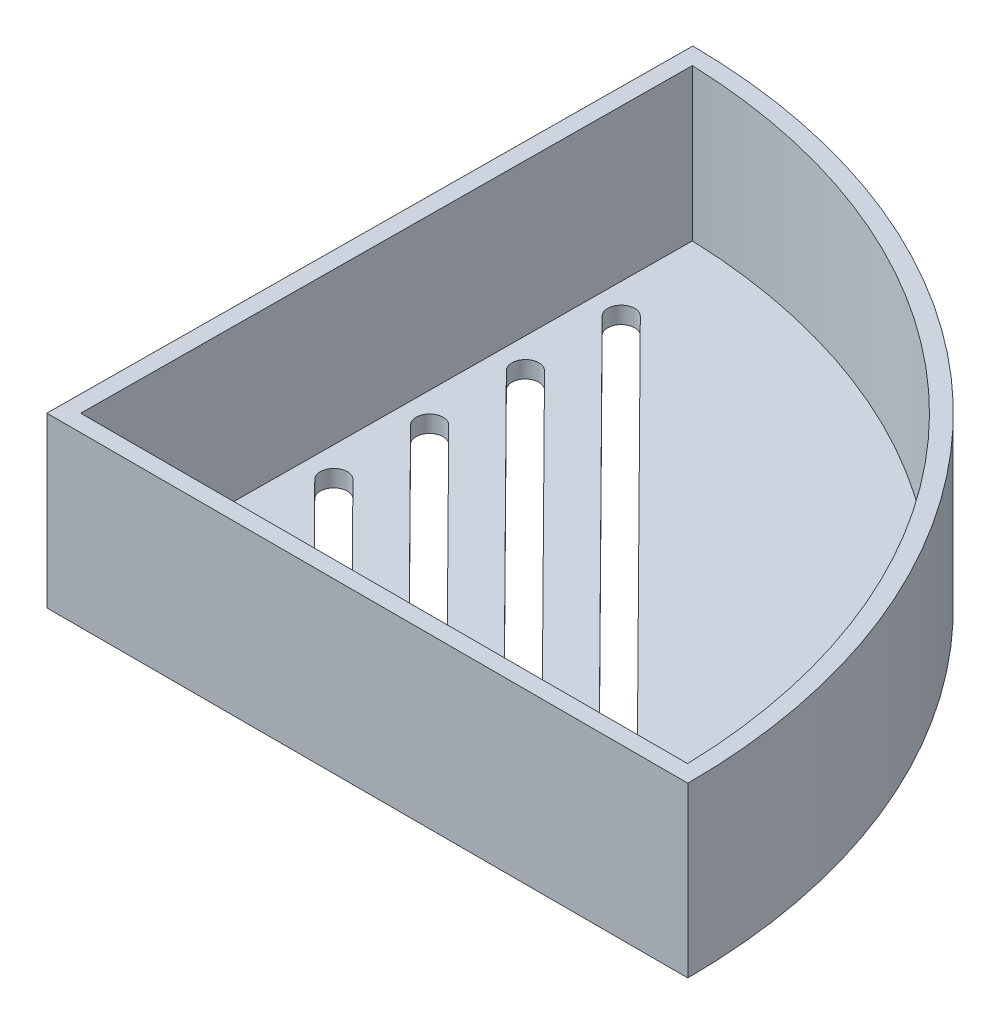
ISO-10303-21;
HEADER;
FILE_DESCRIPTION(('STEP AP214'),'2;1');
FILE_NAME('part.step','',(''),(''),'','','');
FILE_SCHEMA(('AUTOMOTIVE_DESIGN { 1 0 10303 214 1 1 1 1 }'));
ENDSEC;
DATA;
#1=APPLICATION_CONTEXT('core data for automotive mechanical design processes');
#2=APPLICATION_PROTOCOL_DEFINITION('international standard','automotive_design',2000,#1);
#3=PRODUCT_CONTEXT('',#1,'mechanical');
#4=PRODUCT('Part','Part','',(#3));
#5=PRODUCT_RELATED_PRODUCT_CATEGORY('part','',(#4));
#6=PRODUCT_DEFINITION_FORMATION('','',#4);
#7=PRODUCT_DEFINITION_CONTEXT('part definition',#1,'design');
#8=PRODUCT_DEFINITION('design','',#6,#7);
#9=PRODUCT_DEFINITION_SHAPE('','',#8);
#10=(LENGTH_UNIT() NAMED_UNIT(*) SI_UNIT(.MILLI.,.METRE.));
#11=(NAMED_UNIT(*) PLANE_ANGLE_UNIT() SI_UNIT($,.RADIAN.));
#12=(NAMED_UNIT(*) SI_UNIT($,.STERADIAN.) SOLID_ANGLE_UNIT());
#13=UNCERTAINTY_MEASURE_WITH_UNIT(LENGTH_MEASURE(1.E-05),#10,'distance_accuracy_value','');
#14=(GEOMETRIC_REPRESENTATION_CONTEXT(3) GLOBAL_UNCERTAINTY_ASSIGNED_CONTEXT((#13)) GLOBAL_UNIT_ASSIGNED_CONTEXT((#10,
#11,#12)) REPRESENTATION_CONTEXT('',''));
#15=CARTESIAN_POINT('',(0.,0.,0.));
#16=DIRECTION('',(0.,0.,1.));
#17=DIRECTION('',(1.,0.,0.));
#18=AXIS2_PLACEMENT_3D('',#15,#16,#17);
#19=CARTESIAN_POINT('',(0.,50.,0.));
#20=DIRECTION('',(0.,0.,-1.));
#21=DIRECTION('',(-1.,0.,0.));
#22=AXIS2_PLACEMENT_3D('',#19,#20,#21);
#23=PLANE('',#22);
#24=DIRECTION('',(1.,0.,0.));
#25=VECTOR('',#24,1.);
#26=CARTESIAN_POINT('',(0.,0.,0.));
#27=LINE('',#26,#25);
#28=CARTESIAN_POINT('',(0.,0.,0.));
#29=VERTEX_POINT('',#28);
#30=CARTESIAN_POINT('',(190.,0.,0.));
#31=VERTEX_POINT('',#30);
#32=EDGE_CURVE('E394',#29,#31,#27,.T.);
#33=ORIENTED_EDGE('',*,*,#32,.T.);
#34=DIRECTION('',(0.,-1.,0.));
#35=VECTOR('',#34,1.);
#36=CARTESIAN_POINT('',(190.,50.,0.));
#37=LINE('',#36,#35);
#38=CARTESIAN_POINT('',(190.,50.,0.));
#39=VERTEX_POINT('',#38);
#40=EDGE_CURVE('E428',#39,#31,#37,.T.);
#41=ORIENTED_EDGE('',*,*,#40,.F.);
#42=DIRECTION('',(1.,0.,0.));
#43=VECTOR('',#42,1.);
#44=CARTESIAN_POINT('',(0.,50.,0.));
#45=LINE('',#44,#43);
#46=CARTESIAN_POINT('',(0.,50.,0.));
#47=VERTEX_POINT('',#46);
#48=EDGE_CURVE('E401',#47,#39,#45,.T.);
#49=ORIENTED_EDGE('',*,*,#48,.F.);
#50=DIRECTION('',(0.,-1.,0.));
#51=VECTOR('',#50,1.);
#52=CARTESIAN_POINT('',(0.,50.,0.));
#53=LINE('',#52,#51);
#54=EDGE_CURVE('E412',#47,#29,#53,.T.);
#55=ORIENTED_EDGE('',*,*,#54,.T.);
#56=EDGE_LOOP('',(#33,#41,#49,#55));
#57=FACE_BOUND('',#56,.T.);
#58=ADVANCED_FACE('F43',(#57),#23,.F.);
#59=CARTESIAN_POINT('',(0.,50.,0.));
#60=DIRECTION('',(0.,-1.,0.));
#61=DIRECTION('',(0.,0.,-1.));
#62=AXIS2_PLACEMENT_3D('',#59,#60,#61);
#63=CYLINDRICAL_SURFACE('',#62,190.);
#64=CARTESIAN_POINT('',(0.,0.,0.));
#65=DIRECTION('',(0.,1.,0.));
#66=DIRECTION('',(0.,0.,1.));
#67=AXIS2_PLACEMENT_3D('',#64,#65,#66);
#68=CIRCLE('',#67,190.);
#69=CARTESIAN_POINT('',(1.49601661623701,0.,-189.994110262092));
#70=VERTEX_POINT('',#69);
#71=EDGE_CURVE('E416',#31,#70,#68,.T.);
#72=ORIENTED_EDGE('',*,*,#71,.T.);
#73=DIRECTION('',(0.,-1.,0.));
#74=VECTOR('',#73,1.);
#75=CARTESIAN_POINT('',(1.49601661623701,50.,-189.994110262092));
#76=LINE('',#75,#74);
#77=CARTESIAN_POINT('',(1.49601661623701,50.,-189.994110262092));
#78=VERTEX_POINT('',#77);
#79=EDGE_CURVE('E424',#78,#70,#76,.T.);
#80=ORIENTED_EDGE('',*,*,#79,.F.);
#81=CARTESIAN_POINT('',(0.,50.,0.));
#82=DIRECTION('',(0.,1.,0.));
#83=DIRECTION('',(0.,0.,1.));
#84=AXIS2_PLACEMENT_3D('',#81,#82,#83);
#85=CIRCLE('',#84,190.);
#86=EDGE_CURVE('E405',#39,#78,#85,.T.);
#87=ORIENTED_EDGE('',*,*,#86,.F.);
#88=ORIENTED_EDGE('',*,*,#40,.T.);
#89=EDGE_LOOP('',(#72,#80,#87,#88));
#90=FACE_BOUND('',#89,.T.);
#91=ADVANCED_FACE('F540',(#90),#63,.T.);
#92=CARTESIAN_POINT('',(1.49601661623701,50.,-189.994110262092));
#93=DIRECTION('',(0.999969001379431,0.,0.00787377166440531));
#94=DIRECTION('',(0.00787377166440531,0.,-0.999969001379431));
#95=AXIS2_PLACEMENT_3D('',#92,#93,#94);
#96=PLANE('',#95);
#97=DIRECTION('',(-0.00787377166440531,0.,0.999969001379431));
#98=VECTOR('',#97,1.);
#99=CARTESIAN_POINT('',(1.49601661623701,0.,-189.994110262092));
#100=LINE('',#99,#98);
#101=EDGE_CURVE('E406',#70,#29,#100,.T.);
#102=ORIENTED_EDGE('',*,*,#101,.T.);
#103=ORIENTED_EDGE('',*,*,#54,.F.);
#104=DIRECTION('',(-0.00787377166440531,0.,0.999969001379431));
#105=VECTOR('',#104,1.);
#106=CARTESIAN_POINT('',(1.49601661623701,50.,-189.994110262092));
#107=LINE('',#106,#105);
#108=EDGE_CURVE('E409',#78,#47,#107,.T.);
#109=ORIENTED_EDGE('',*,*,#108,.F.);
#110=ORIENTED_EDGE('',*,*,#79,.T.);
#111=EDGE_LOOP('',(#102,#103,#109,#110));
#112=FACE_BOUND('',#111,.T.);
#113=ADVANCED_FACE('F545',(#112),#96,.F.);
#114=CARTESIAN_POINT('',(0.,50.,0.));
#115=DIRECTION('',(0.,1.,0.));
#116=DIRECTION('',(0.,0.,1.));
#117=AXIS2_PLACEMENT_3D('',#114,#115,#116);
#118=PLANE('',#117);
#119=DIRECTION('',(-0.00787377166440531,0.,0.999969001379431));
#120=VECTOR('',#119,1.);
#121=CARTESIAN_POINT('',(6.45596065602437,50.,-184.887318580826));
#122=LINE('',#121,#120);
#123=CARTESIAN_POINT('',(6.45596065602437,50.,-184.887318580826));
#124=VERTEX_POINT('',#123);
#125=CARTESIAN_POINT('',(5.03952507664773,50.,-5.));
#126=VERTEX_POINT('',#125);
#127=EDGE_CURVE('E358',#124,#126,#122,.T.);
#128=ORIENTED_EDGE('',*,*,#127,.F.);
#129=CARTESIAN_POINT('',(0.,50.,0.));
#130=DIRECTION('',(0.,1.,0.));
#131=DIRECTION('',(0.,0.,1.));
#132=AXIS2_PLACEMENT_3D('',#129,#130,#131);
#133=CIRCLE('',#132,185.);
#134=CARTESIAN_POINT('',(184.932420089069,50.,-4.99999999999999));
#135=VERTEX_POINT('',#134);
#136=EDGE_CURVE('E373',#135,#124,#133,.T.);
#137=ORIENTED_EDGE('',*,*,#136,.F.);
#138=DIRECTION('',(1.,0.,0.));
#139=VECTOR('',#138,1.);
#140=CARTESIAN_POINT('',(5.03952507664773,50.,-5.));
#141=LINE('',#140,#139);
#142=EDGE_CURVE('E384',#126,#135,#141,.T.);
#143=ORIENTED_EDGE('',*,*,#142,.F.);
#144=EDGE_LOOP('',(#128,#137,#143));
#145=FACE_BOUND('',#144,.T.);
#146=ORIENTED_EDGE('',*,*,#48,.T.);
#147=ORIENTED_EDGE('',*,*,#86,.T.);
#148=ORIENTED_EDGE('',*,*,#108,.T.);
#149=EDGE_LOOP('',(#146,#147,#148));
#150=FACE_BOUND('',#149,.T.);
#151=ADVANCED_FACE('F512',(#145,#150),#118,.T.);
#152=CARTESIAN_POINT('',(0.,0.,0.));
#153=DIRECTION('',(0.,1.,0.));
#154=DIRECTION('',(0.,0.,1.));
#155=AXIS2_PLACEMENT_3D('',#152,#153,#154);
#156=PLANE('',#155);
#157=DIRECTION('',(0.704317481089173,0.,0.709885121574049));
#158=VECTOR('',#157,1.);
#159=CARTESIAN_POINT('',(17.838899647507,0.,-129.680766142191));
#160=LINE('',#159,#158);
#161=CARTESIAN_POINT('',(17.838899647507,0.,-129.680766142191));
#162=VERTEX_POINT('',#161);
#163=CARTESIAN_POINT('',(129.817205639895,0.,-16.8172699243567));
#164=VERTEX_POINT('',#163);
#165=EDGE_CURVE('E261',#162,#164,#160,.T.);
#166=ORIENTED_EDGE('',*,*,#165,.F.);
#167=CARTESIAN_POINT('',(14.9993591612108,0.,-126.863496217835));
#168=DIRECTION('',(0.,-1.,0.));
#169=DIRECTION('',(0.,0.,-1.));
#170=AXIS2_PLACEMENT_3D('',#167,#168,#169);
#171=CIRCLE('',#170,3.99999999999999);
#172=CARTESIAN_POINT('',(12.1598186749146,0.,-124.046226293478));
#173=VERTEX_POINT('',#172);
#174=EDGE_CURVE('E58',#173,#162,#171,.T.);
#175=ORIENTED_EDGE('',*,*,#174,.F.);
#176=DIRECTION('',(-0.704317481089173,0.,-0.709885121574049));
#177=VECTOR('',#176,1.);
#178=CARTESIAN_POINT('',(12.1598186749146,0.,-124.046226293478));
#179=LINE('',#178,#177);
#180=CARTESIAN_POINT('',(124.138124667303,0.,-11.1827300756433));
#181=VERTEX_POINT('',#180);
#182=EDGE_CURVE('E269',#181,#173,#179,.T.);
#183=ORIENTED_EDGE('',*,*,#182,.F.);
#184=CARTESIAN_POINT('',(126.977665153599,0.,-14.));
#185=DIRECTION('',(0.,-1.,0.));
#186=DIRECTION('',(0.,0.,-1.));
#187=AXIS2_PLACEMENT_3D('',#184,#185,#186);
#188=CIRCLE('',#187,4.);
#189=EDGE_CURVE('E265',#164,#181,#188,.T.);
#190=ORIENTED_EDGE('',*,*,#189,.F.);
#191=EDGE_LOOP('',(#166,#175,#183,#190));
#192=FACE_BOUND('',#191,.T.);
#193=DIRECTION('',(0.704317481089173,0.,0.709885121574049));
#194=VECTOR('',#193,1.);
#195=CARTESIAN_POINT('',(17.6170673699986,0.,-101.508066898624));
#196=LINE('',#195,#194);
#197=CARTESIAN_POINT('',(17.6170673699985,0.,-101.508066898624));
#198=VERTEX_POINT('',#197);
#199=CARTESIAN_POINT('',(101.643633054442,0.,-16.8172699243567));
#200=VERTEX_POINT('',#199);
#201=EDGE_CURVE('E287',#198,#200,#196,.T.);
#202=ORIENTED_EDGE('',*,*,#201,.F.);
#203=CARTESIAN_POINT('',(14.7775268837024,0.,-98.6907969742677));
#204=DIRECTION('',(0.,-1.,0.));
#205=DIRECTION('',(0.,0.,-1.));
#206=AXIS2_PLACEMENT_3D('',#203,#204,#205);
#207=CIRCLE('',#206,4.00000000000001);
#208=CARTESIAN_POINT('',(11.9379863974062,0.,-95.873527049911));
#209=VERTEX_POINT('',#208);
#210=EDGE_CURVE('E66',#209,#198,#207,.T.);
#211=ORIENTED_EDGE('',*,*,#210,.F.);
#212=DIRECTION('',(-0.704317481089173,0.,-0.709885121574049));
#213=VECTOR('',#212,1.);
#214=CARTESIAN_POINT('',(11.9379863974062,0.,-95.873527049911));
#215=LINE('',#214,#213);
#216=CARTESIAN_POINT('',(95.9645520818493,0.,-11.1827300756433));
#217=VERTEX_POINT('',#216);
#218=EDGE_CURVE('E295',#217,#209,#215,.T.);
#219=ORIENTED_EDGE('',*,*,#218,.F.);
#220=CARTESIAN_POINT('',(98.8040925681455,0.,-14.));
#221=DIRECTION('',(0.,-1.,0.));
#222=DIRECTION('',(0.,0.,-1.));
#223=AXIS2_PLACEMENT_3D('',#220,#221,#222);
#224=CIRCLE('',#223,4.00000000000001);
#225=EDGE_CURVE('E291',#200,#217,#224,.T.);
#226=ORIENTED_EDGE('',*,*,#225,.F.);
#227=EDGE_LOOP('',(#202,#211,#219,#226));
#228=FACE_BOUND('',#227,.T.);
#229=DIRECTION('',(0.704317481089173,0.,0.709885121574049));
#230=VECTOR('',#229,1.);
#231=CARTESIAN_POINT('',(18.0607319250154,0.,-157.853465385758));
#232=LINE('',#231,#230);
#233=CARTESIAN_POINT('',(18.0607319250154,0.,-157.853465385758));
#234=VERTEX_POINT('',#233);
#235=CARTESIAN_POINT('',(157.990778225349,0.,-16.8172699243567));
#236=VERTEX_POINT('',#235);
#237=EDGE_CURVE('E234',#234,#236,#232,.T.);
#238=ORIENTED_EDGE('',*,*,#237,.F.);
#239=CARTESIAN_POINT('',(15.2211914387192,0.,-155.036195461402));
#240=DIRECTION('',(0.,-1.,0.));
#241=DIRECTION('',(0.,0.,-1.));
#242=AXIS2_PLACEMENT_3D('',#239,#240,#241);
#243=CIRCLE('',#242,3.99999999999999);
#244=CARTESIAN_POINT('',(12.381650952423,0.,-152.218925537045));
#245=VERTEX_POINT('',#244);
#246=EDGE_CURVE('E240',#245,#234,#243,.T.);
#247=ORIENTED_EDGE('',*,*,#246,.F.);
#248=DIRECTION('',(-0.704317481089173,0.,-0.709885121574049));
#249=VECTOR('',#248,1.);
#250=CARTESIAN_POINT('',(12.381650952423,0.,-152.218925537045));
#251=LINE('',#250,#249);
#252=CARTESIAN_POINT('',(152.311697252756,0.,-11.1827300756433));
#253=VERTEX_POINT('',#252);
#254=EDGE_CURVE('E245',#253,#245,#251,.T.);
#255=ORIENTED_EDGE('',*,*,#254,.F.);
#256=CARTESIAN_POINT('',(155.151237739053,0.,-14.));
#257=DIRECTION('',(0.,-1.,0.));
#258=DIRECTION('',(0.,0.,-1.));
#259=AXIS2_PLACEMENT_3D('',#256,#257,#258);
#260=CIRCLE('',#259,3.99999999999999);
#261=EDGE_CURVE('E222',#236,#253,#260,.T.);
#262=ORIENTED_EDGE('',*,*,#261,.F.);
#263=EDGE_LOOP('',(#238,#247,#255,#262));
#264=FACE_BOUND('',#263,.T.);
#265=DIRECTION('',(0.704317481089173,0.,0.709885121574049));
#266=VECTOR('',#265,1.);
#267=CARTESIAN_POINT('',(17.3952350924902,0.,-73.3353676550575));
#268=LINE('',#267,#266);
#269=CARTESIAN_POINT('',(17.3952350924901,0.,-73.3353676550575));
#270=VERTEX_POINT('',#269);
#271=CARTESIAN_POINT('',(73.4700604689882,0.,-16.8172699243567));
#272=VERTEX_POINT('',#271);
#273=EDGE_CURVE('E314',#270,#272,#268,.T.);
#274=ORIENTED_EDGE('',*,*,#273,.F.);
#275=CARTESIAN_POINT('',(14.5556946061939,0.,-70.5180977307008));
#276=DIRECTION('',(0.,-1.,0.));
#277=DIRECTION('',(0.,0.,-1.));
#278=AXIS2_PLACEMENT_3D('',#275,#276,#277);
#279=CIRCLE('',#278,4.00000000000001);
#280=CARTESIAN_POINT('',(11.7161541198977,0.,-67.7008278063441));
#281=VERTEX_POINT('',#280);
#282=EDGE_CURVE('E303',#281,#270,#279,.T.);
#283=ORIENTED_EDGE('',*,*,#282,.F.);
#284=DIRECTION('',(-0.704317481089173,0.,-0.709885121574049));
#285=VECTOR('',#284,1.);
#286=CARTESIAN_POINT('',(11.7161541198977,0.,-67.7008278063441));
#287=LINE('',#286,#285);
#288=CARTESIAN_POINT('',(67.7909794963957,0.,-11.1827300756433));
#289=VERTEX_POINT('',#288);
#290=EDGE_CURVE('E322',#289,#281,#287,.T.);
#291=ORIENTED_EDGE('',*,*,#290,.F.);
#292=CARTESIAN_POINT('',(70.6305199826919,0.,-14.));
#293=DIRECTION('',(0.,-1.,0.));
#294=DIRECTION('',(0.,0.,-1.));
#295=AXIS2_PLACEMENT_3D('',#292,#293,#294);
#296=CIRCLE('',#295,4.00000000000002);
#297=EDGE_CURVE('E318',#272,#289,#296,.T.);
#298=ORIENTED_EDGE('',*,*,#297,.F.);
#299=EDGE_LOOP('',(#274,#283,#291,#298));
#300=FACE_BOUND('',#299,.T.);
#301=DIRECTION('',(0.704317481089173,0.,0.709885121574049));
#302=VECTOR('',#301,1.);
#303=CARTESIAN_POINT('',(17.1734028149817,0.,-45.1626684114906));
#304=LINE('',#303,#302);
#305=CARTESIAN_POINT('',(17.1734028149817,0.,-45.1626684114906));
#306=VERTEX_POINT('',#305);
#307=CARTESIAN_POINT('',(45.2964878835346,0.,-16.8172699243566));
#308=VERTEX_POINT('',#307);
#309=EDGE_CURVE('E342',#306,#308,#304,.T.);
#310=ORIENTED_EDGE('',*,*,#309,.F.);
#311=CARTESIAN_POINT('',(14.3338623286855,0.,-42.3453984871339));
#312=DIRECTION('',(0.,-1.,0.));
#313=DIRECTION('',(0.,0.,-1.));
#314=AXIS2_PLACEMENT_3D('',#311,#312,#313);
#315=CIRCLE('',#314,3.99999999999999);
#316=CARTESIAN_POINT('',(11.4943218423893,0.,-39.5281285627772));
#317=VERTEX_POINT('',#316);
#318=EDGE_CURVE('E330',#317,#306,#315,.T.);
#319=ORIENTED_EDGE('',*,*,#318,.F.);
#320=DIRECTION('',(-0.704317481089173,0.,-0.709885121574049));
#321=VECTOR('',#320,1.);
#322=CARTESIAN_POINT('',(11.4943218423893,0.,-39.5281285627772));
#323=LINE('',#322,#321);
#324=CARTESIAN_POINT('',(39.6174069109422,0.,-11.1827300756433));
#325=VERTEX_POINT('',#324);
#326=EDGE_CURVE('E350',#325,#317,#323,.T.);
#327=ORIENTED_EDGE('',*,*,#326,.F.);
#328=CARTESIAN_POINT('',(42.4569473972384,0.,-14.));
#329=DIRECTION('',(0.,-1.,0.));
#330=DIRECTION('',(0.,0.,-1.));
#331=AXIS2_PLACEMENT_3D('',#328,#329,#330);
#332=CIRCLE('',#331,3.99999999999999);
#333=EDGE_CURVE('E346',#308,#325,#332,.T.);
#334=ORIENTED_EDGE('',*,*,#333,.F.);
#335=EDGE_LOOP('',(#310,#319,#327,#334));
#336=FACE_BOUND('',#335,.T.);
#337=ORIENTED_EDGE('',*,*,#32,.F.);
#338=ORIENTED_EDGE('',*,*,#101,.F.);
#339=ORIENTED_EDGE('',*,*,#71,.F.);
#340=EDGE_LOOP('',(#337,#338,#339));
#341=FACE_BOUND('',#340,.T.);
#342=ADVANCED_FACE('F242',(#192,#228,#264,#300,#336,#341),#156,.F.);
#343=CARTESIAN_POINT('',(6.45596065602437,5.,-184.887318580826));
#344=DIRECTION('',(-0.999969001379431,0.,-0.00787377166440531));
#345=DIRECTION('',(-0.00787377166440531,0.,0.999969001379431));
#346=AXIS2_PLACEMENT_3D('',#343,#344,#345);
#347=PLANE('',#346);
#348=ORIENTED_EDGE('',*,*,#127,.T.);
#349=DIRECTION('',(0.,1.,0.));
#350=VECTOR('',#349,1.);
#351=CARTESIAN_POINT('',(5.03952507664773,5.,-5.));
#352=LINE('',#351,#350);
#353=CARTESIAN_POINT('',(5.03952507664773,5.,-5.));
#354=VERTEX_POINT('',#353);
#355=EDGE_CURVE('E381',#354,#126,#352,.T.);
#356=ORIENTED_EDGE('',*,*,#355,.F.);
#357=DIRECTION('',(-0.00787377166440531,0.,0.999969001379431));
#358=VECTOR('',#357,1.);
#359=CARTESIAN_POINT('',(6.45596065602437,5.,-184.887318580826));
#360=LINE('',#359,#358);
#361=CARTESIAN_POINT('',(6.45596065602437,5.,-184.887318580826));
#362=VERTEX_POINT('',#361);
#363=EDGE_CURVE('E368',#362,#354,#360,.T.);
#364=ORIENTED_EDGE('',*,*,#363,.F.);
#365=DIRECTION('',(0.,1.,0.));
#366=VECTOR('',#365,1.);
#367=CARTESIAN_POINT('',(6.45596065602437,5.,-184.887318580826));
#368=LINE('',#367,#366);
#369=EDGE_CURVE('E391',#362,#124,#368,.T.);
#370=ORIENTED_EDGE('',*,*,#369,.T.);
#371=EDGE_LOOP('',(#348,#356,#364,#370));
#372=FACE_BOUND('',#371,.T.);
#373=ADVANCED_FACE('F511',(#372),#347,.F.);
#374=CARTESIAN_POINT('',(0.,5.,0.));
#375=DIRECTION('',(0.,1.,0.));
#376=DIRECTION('',(0.,0.,1.));
#377=AXIS2_PLACEMENT_3D('',#374,#375,#376);
#378=CYLINDRICAL_SURFACE('',#377,185.);
#379=ORIENTED_EDGE('',*,*,#136,.T.);
#380=ORIENTED_EDGE('',*,*,#369,.F.);
#381=CARTESIAN_POINT('',(0.,5.,0.));
#382=DIRECTION('',(0.,1.,0.));
#383=DIRECTION('',(0.,0.,1.));
#384=AXIS2_PLACEMENT_3D('',#381,#382,#383);
#385=CIRCLE('',#384,185.);
#386=CARTESIAN_POINT('',(184.932420089069,5.,-4.99999999999999));
#387=VERTEX_POINT('',#386);
#388=EDGE_CURVE('E377',#387,#362,#385,.T.);
#389=ORIENTED_EDGE('',*,*,#388,.F.);
#390=DIRECTION('',(0.,1.,0.));
#391=VECTOR('',#390,1.);
#392=CARTESIAN_POINT('',(184.932420089069,5.,-4.99999999999999));
#393=LINE('',#392,#391);
#394=EDGE_CURVE('E395',#387,#135,#393,.T.);
#395=ORIENTED_EDGE('',*,*,#394,.T.);
#396=EDGE_LOOP('',(#379,#380,#389,#395));
#397=FACE_BOUND('',#396,.T.);
#398=ADVANCED_FACE('F567',(#397),#378,.F.);
#399=CARTESIAN_POINT('',(5.03952507664773,5.,-5.));
#400=DIRECTION('',(0.,0.,1.));
#401=DIRECTION('',(1.,0.,0.));
#402=AXIS2_PLACEMENT_3D('',#399,#400,#401);
#403=PLANE('',#402);
#404=ORIENTED_EDGE('',*,*,#142,.T.);
#405=ORIENTED_EDGE('',*,*,#394,.F.);
#406=DIRECTION('',(1.,0.,0.));
#407=VECTOR('',#406,1.);
#408=CARTESIAN_POINT('',(5.03952507664773,5.,-5.));
#409=LINE('',#408,#407);
#410=EDGE_CURVE('E372',#354,#387,#409,.T.);
#411=ORIENTED_EDGE('',*,*,#410,.F.);
#412=ORIENTED_EDGE('',*,*,#355,.T.);
#413=EDGE_LOOP('',(#404,#405,#411,#412));
#414=FACE_BOUND('',#413,.T.);
#415=ADVANCED_FACE('F569',(#414),#403,.F.);
#416=CARTESIAN_POINT('',(0.,5.,0.));
#417=DIRECTION('',(0.,1.,0.));
#418=DIRECTION('',(0.,0.,1.));
#419=AXIS2_PLACEMENT_3D('',#416,#417,#418);
#420=PLANE('',#419);
#421=CARTESIAN_POINT('',(14.9993591612108,5.,-126.863496217835));
#422=DIRECTION('',(0.,1.,0.));
#423=DIRECTION('',(0.,0.,1.));
#424=AXIS2_PLACEMENT_3D('',#421,#422,#423);
#425=CIRCLE('',#424,3.99999999999999);
#426=CARTESIAN_POINT('',(17.838899647507,5.,-129.680766142191));
#427=VERTEX_POINT('',#426);
#428=CARTESIAN_POINT('',(12.1598186749146,5.,-124.046226293478));
#429=VERTEX_POINT('',#428);
#430=EDGE_CURVE('E11',#427,#429,#425,.T.);
#431=ORIENTED_EDGE('',*,*,#430,.F.);
#432=DIRECTION('',(-0.704317481089173,0.,-0.709885121574049));
#433=VECTOR('',#432,1.);
#434=CARTESIAN_POINT('',(73.8280526437011,5.,-73.249018033274));
#435=LINE('',#434,#433);
#436=CARTESIAN_POINT('',(129.817205639895,5.,-16.8172699243567));
#437=VERTEX_POINT('',#436);
#438=EDGE_CURVE('E482',#437,#427,#435,.T.);
#439=ORIENTED_EDGE('',*,*,#438,.F.);
#440=CARTESIAN_POINT('',(126.977665153599,5.,-14.));
#441=DIRECTION('',(0.,1.,0.));
#442=DIRECTION('',(0.,0.,1.));
#443=AXIS2_PLACEMENT_3D('',#440,#441,#442);
#444=CIRCLE('',#443,4.);
#445=CARTESIAN_POINT('',(124.138124667303,5.,-11.1827300756433));
#446=VERTEX_POINT('',#445);
#447=EDGE_CURVE('E485',#446,#437,#444,.T.);
#448=ORIENTED_EDGE('',*,*,#447,.F.);
#449=DIRECTION('',(0.704317481089173,0.,0.709885121574049));
#450=VECTOR('',#449,1.);
#451=CARTESIAN_POINT('',(68.1489716711087,5.,-67.6144781845606));
#452=LINE('',#451,#450);
#453=EDGE_CURVE('E51',#429,#446,#452,.T.);
#454=ORIENTED_EDGE('',*,*,#453,.F.);
#455=EDGE_LOOP('',(#431,#439,#448,#454));
#456=FACE_BOUND('',#455,.T.);
#457=CARTESIAN_POINT('',(14.7775268837024,5.,-98.6907969742677));
#458=DIRECTION('',(0.,1.,0.));
#459=DIRECTION('',(0.,0.,1.));
#460=AXIS2_PLACEMENT_3D('',#457,#458,#459);
#461=CIRCLE('',#460,4.00000000000001);
#462=CARTESIAN_POINT('',(17.6170673699986,5.,-101.508066898624));
#463=VERTEX_POINT('',#462);
#464=CARTESIAN_POINT('',(11.9379863974062,5.,-95.873527049911));
#465=VERTEX_POINT('',#464);
#466=EDGE_CURVE('E479',#463,#465,#461,.T.);
#467=ORIENTED_EDGE('',*,*,#466,.F.);
#468=DIRECTION('',(-0.704317481089173,0.,-0.709885121574049));
#469=VECTOR('',#468,1.);
#470=CARTESIAN_POINT('',(59.6303502122202,5.,-59.1626684114905));
#471=LINE('',#470,#469);
#472=CARTESIAN_POINT('',(101.643633054442,5.,-16.8172699243567));
#473=VERTEX_POINT('',#472);
#474=EDGE_CURVE('E469',#473,#463,#471,.T.);
#475=ORIENTED_EDGE('',*,*,#474,.F.);
#476=CARTESIAN_POINT('',(98.8040925681455,5.,-14.));
#477=DIRECTION('',(0.,1.,0.));
#478=DIRECTION('',(0.,0.,1.));
#479=AXIS2_PLACEMENT_3D('',#476,#477,#478);
#480=CIRCLE('',#479,4.00000000000001);
#481=CARTESIAN_POINT('',(95.9645520818493,5.,-11.1827300756433));
#482=VERTEX_POINT('',#481);
#483=EDGE_CURVE('E472',#482,#473,#480,.T.);
#484=ORIENTED_EDGE('',*,*,#483,.F.);
#485=DIRECTION('',(0.704317481089173,0.,0.709885121574049));
#486=VECTOR('',#485,1.);
#487=CARTESIAN_POINT('',(53.9512692396277,5.,-53.5281285627772));
#488=LINE('',#487,#486);
#489=EDGE_CURVE('E476',#465,#482,#488,.T.);
#490=ORIENTED_EDGE('',*,*,#489,.F.);
#491=EDGE_LOOP('',(#467,#475,#484,#490));
#492=FACE_BOUND('',#491,.T.);
#493=CARTESIAN_POINT('',(15.2211914387192,5.,-155.036195461402));
#494=DIRECTION('',(0.,1.,0.));
#495=DIRECTION('',(0.,0.,1.));
#496=AXIS2_PLACEMENT_3D('',#493,#494,#495);
#497=CIRCLE('',#496,3.99999999999999);
#498=CARTESIAN_POINT('',(18.0607319250154,5.,-157.853465385758));
#499=VERTEX_POINT('',#498);
#500=CARTESIAN_POINT('',(12.381650952423,5.,-152.218925537045));
#501=VERTEX_POINT('',#500);
#502=EDGE_CURVE('E466',#499,#501,#497,.T.);
#503=ORIENTED_EDGE('',*,*,#502,.F.);
#504=DIRECTION('',(-0.704317481089173,0.,-0.709885121574049));
#505=VECTOR('',#504,1.);
#506=CARTESIAN_POINT('',(88.0257550751821,5.,-87.3353676550574));
#507=LINE('',#506,#505);
#508=CARTESIAN_POINT('',(157.990778225349,5.,-16.8172699243567));
#509=VERTEX_POINT('',#508);
#510=EDGE_CURVE('E458',#509,#499,#507,.T.);
#511=ORIENTED_EDGE('',*,*,#510,.F.);
#512=CARTESIAN_POINT('',(155.151237739053,5.,-14.));
#513=DIRECTION('',(0.,1.,0.));
#514=DIRECTION('',(0.,0.,1.));
#515=AXIS2_PLACEMENT_3D('',#512,#513,#514);
#516=CIRCLE('',#515,3.99999999999999);
#517=CARTESIAN_POINT('',(152.311697252756,5.,-11.1827300756433));
#518=VERTEX_POINT('',#517);
#519=EDGE_CURVE('E225',#518,#509,#516,.T.);
#520=ORIENTED_EDGE('',*,*,#519,.F.);
#521=DIRECTION('',(0.704317481089173,0.,0.709885121574049));
#522=VECTOR('',#521,1.);
#523=CARTESIAN_POINT('',(82.3466741025897,5.,-81.7008278063441));
#524=LINE('',#523,#522);
#525=EDGE_CURVE('E463',#501,#518,#524,.T.);
#526=ORIENTED_EDGE('',*,*,#525,.F.);
#527=EDGE_LOOP('',(#503,#511,#520,#526));
#528=FACE_BOUND('',#527,.T.);
#529=CARTESIAN_POINT('',(14.5556946061939,5.,-70.5180977307008));
#530=DIRECTION('',(0.,1.,0.));
#531=DIRECTION('',(0.,0.,1.));
#532=AXIS2_PLACEMENT_3D('',#529,#530,#531);
#533=CIRCLE('',#532,4.00000000000001);
#534=CARTESIAN_POINT('',(17.3952350924902,5.,-73.3353676550575));
#535=VERTEX_POINT('',#534);
#536=CARTESIAN_POINT('',(11.7161541198977,5.,-67.7008278063441));
#537=VERTEX_POINT('',#536);
#538=EDGE_CURVE('E455',#535,#537,#533,.T.);
#539=ORIENTED_EDGE('',*,*,#538,.F.);
#540=DIRECTION('',(-0.704317481089173,0.,-0.709885121574049));
#541=VECTOR('',#540,1.);
#542=CARTESIAN_POINT('',(45.4326477807392,5.,-45.0763187897071));
#543=LINE('',#542,#541);
#544=CARTESIAN_POINT('',(73.4700604689882,5.,-16.8172699243567));
#545=VERTEX_POINT('',#544);
#546=EDGE_CURVE('E445',#545,#535,#543,.T.);
#547=ORIENTED_EDGE('',*,*,#546,.F.);
#548=CARTESIAN_POINT('',(70.6305199826919,5.,-14.));
#549=DIRECTION('',(0.,1.,0.));
#550=DIRECTION('',(0.,0.,1.));
#551=AXIS2_PLACEMENT_3D('',#548,#549,#550);
#552=CIRCLE('',#551,4.00000000000002);
#553=CARTESIAN_POINT('',(67.7909794963957,5.,-11.1827300756433));
#554=VERTEX_POINT('',#553);
#555=EDGE_CURVE('E448',#554,#545,#552,.T.);
#556=ORIENTED_EDGE('',*,*,#555,.F.);
#557=DIRECTION('',(0.704317481089173,0.,0.709885121574049));
#558=VECTOR('',#557,1.);
#559=CARTESIAN_POINT('',(39.7535668081468,5.,-39.4417789409937));
#560=LINE('',#559,#558);
#561=EDGE_CURVE('E452',#537,#554,#560,.T.);
#562=ORIENTED_EDGE('',*,*,#561,.F.);
#563=EDGE_LOOP('',(#539,#547,#556,#562));
#564=FACE_BOUND('',#563,.T.);
#565=CARTESIAN_POINT('',(14.3338623286855,5.,-42.3453984871339));
#566=DIRECTION('',(0.,1.,0.));
#567=DIRECTION('',(0.,0.,1.));
#568=AXIS2_PLACEMENT_3D('',#565,#566,#567);
#569=CIRCLE('',#568,3.99999999999999);
#570=CARTESIAN_POINT('',(17.1734028149817,5.,-45.1626684114906));
#571=VERTEX_POINT('',#570);
#572=CARTESIAN_POINT('',(11.4943218423893,5.,-39.5281285627772));
#573=VERTEX_POINT('',#572);
#574=EDGE_CURVE('E442',#571,#573,#569,.T.);
#575=ORIENTED_EDGE('',*,*,#574,.F.);
#576=DIRECTION('',(-0.704317481089173,0.,-0.709885121574049));
#577=VECTOR('',#576,1.);
#578=CARTESIAN_POINT('',(31.2349453492582,5.,-30.9899691679236));
#579=LINE('',#578,#577);
#580=CARTESIAN_POINT('',(45.2964878835346,5.,-16.8172699243566));
#581=VERTEX_POINT('',#580);
#582=EDGE_CURVE('E432',#581,#571,#579,.T.);
#583=ORIENTED_EDGE('',*,*,#582,.F.);
#584=CARTESIAN_POINT('',(42.4569473972384,5.,-14.));
#585=DIRECTION('',(0.,1.,0.));
#586=DIRECTION('',(0.,0.,1.));
#587=AXIS2_PLACEMENT_3D('',#584,#585,#586);
#588=CIRCLE('',#587,3.99999999999999);
#589=CARTESIAN_POINT('',(39.6174069109422,5.,-11.1827300756433));
#590=VERTEX_POINT('',#589);
#591=EDGE_CURVE('E435',#590,#581,#588,.T.);
#592=ORIENTED_EDGE('',*,*,#591,.F.);
#593=DIRECTION('',(0.704317481089173,0.,0.709885121574049));
#594=VECTOR('',#593,1.);
#595=CARTESIAN_POINT('',(25.5558643766658,5.,-25.3554293192102));
#596=LINE('',#595,#594);
#597=EDGE_CURVE('E439',#573,#590,#596,.T.);
#598=ORIENTED_EDGE('',*,*,#597,.F.);
#599=EDGE_LOOP('',(#575,#583,#592,#598));
#600=FACE_BOUND('',#599,.T.);
#601=ORIENTED_EDGE('',*,*,#363,.T.);
#602=ORIENTED_EDGE('',*,*,#410,.T.);
#603=ORIENTED_EDGE('',*,*,#388,.T.);
#604=EDGE_LOOP('',(#601,#602,#603));
#605=FACE_BOUND('',#604,.T.);
#606=ADVANCED_FACE('F502',(#456,#492,#528,#564,#600,#605),#420,.T.);
#607=CARTESIAN_POINT('',(14.3338623286855,50.,-42.3453984871339));
#608=DIRECTION('',(0.,-1.,0.));
#609=DIRECTION('',(0.,0.,-1.));
#610=AXIS2_PLACEMENT_3D('',#607,#608,#609);
#611=CYLINDRICAL_SURFACE('',#610,3.99999999999999);
#612=ORIENTED_EDGE('',*,*,#574,.T.);
#613=DIRECTION('',(0.,-1.,0.));
#614=VECTOR('',#613,1.);
#615=CARTESIAN_POINT('',(11.4943218423893,50.,-39.5281285627772));
#616=LINE('',#615,#614);
#617=EDGE_CURVE('E355',#573,#317,#616,.T.);
#618=ORIENTED_EDGE('',*,*,#617,.T.);
#619=ORIENTED_EDGE('',*,*,#318,.T.);
#620=DIRECTION('',(0.,-1.,0.));
#621=VECTOR('',#620,1.);
#622=CARTESIAN_POINT('',(17.1734028149817,50.,-45.1626684114906));
#623=LINE('',#622,#621);
#624=EDGE_CURVE('E354',#571,#306,#623,.T.);
#625=ORIENTED_EDGE('',*,*,#624,.F.);
#626=EDGE_LOOP('',(#612,#618,#619,#625));
#627=FACE_BOUND('',#626,.T.);
#628=ADVANCED_FACE('F578',(#627),#611,.F.);
#629=CARTESIAN_POINT('',(11.4943218423893,50.,-39.5281285627772));
#630=DIRECTION('',(-0.709885121574049,0.,0.704317481089173));
#631=DIRECTION('',(0.704317481089173,0.,0.709885121574049));
#632=AXIS2_PLACEMENT_3D('',#629,#630,#631);
#633=PLANE('',#632);
#634=ORIENTED_EDGE('',*,*,#597,.T.);
#635=DIRECTION('',(0.,-1.,0.));
#636=VECTOR('',#635,1.);
#637=CARTESIAN_POINT('',(39.6174069109422,50.,-11.1827300756433));
#638=LINE('',#637,#636);
#639=EDGE_CURVE('E359',#590,#325,#638,.T.);
#640=ORIENTED_EDGE('',*,*,#639,.T.);
#641=ORIENTED_EDGE('',*,*,#326,.T.);
#642=ORIENTED_EDGE('',*,*,#617,.F.);
#643=EDGE_LOOP('',(#634,#640,#641,#642));
#644=FACE_BOUND('',#643,.T.);
#645=ADVANCED_FACE('F581',(#644),#633,.F.);
#646=CARTESIAN_POINT('',(42.4569473972384,50.,-14.));
#647=DIRECTION('',(0.,-1.,0.));
#648=DIRECTION('',(0.,0.,-1.));
#649=AXIS2_PLACEMENT_3D('',#646,#647,#648);
#650=CYLINDRICAL_SURFACE('',#649,3.99999999999999);
#651=ORIENTED_EDGE('',*,*,#591,.T.);
#652=DIRECTION('',(0.,-1.,0.));
#653=VECTOR('',#652,1.);
#654=CARTESIAN_POINT('',(45.2964878835346,50.,-16.8172699243566));
#655=LINE('',#654,#653);
#656=EDGE_CURVE('E362',#581,#308,#655,.T.);
#657=ORIENTED_EDGE('',*,*,#656,.T.);
#658=ORIENTED_EDGE('',*,*,#333,.T.);
#659=ORIENTED_EDGE('',*,*,#639,.F.);
#660=EDGE_LOOP('',(#651,#657,#658,#659));
#661=FACE_BOUND('',#660,.T.);
#662=ADVANCED_FACE('F587',(#661),#650,.F.);
#663=CARTESIAN_POINT('',(17.1734028149817,50.,-45.1626684114906));
#664=DIRECTION('',(0.709885121574049,0.,-0.704317481089173));
#665=DIRECTION('',(-0.704317481089173,0.,-0.709885121574049));
#666=AXIS2_PLACEMENT_3D('',#663,#664,#665);
#667=PLANE('',#666);
#668=ORIENTED_EDGE('',*,*,#582,.T.);
#669=ORIENTED_EDGE('',*,*,#624,.T.);
#670=ORIENTED_EDGE('',*,*,#309,.T.);
#671=ORIENTED_EDGE('',*,*,#656,.F.);
#672=EDGE_LOOP('',(#668,#669,#670,#671));
#673=FACE_BOUND('',#672,.T.);
#674=ADVANCED_FACE('F583',(#673),#667,.F.);
#675=CARTESIAN_POINT('',(14.5556946061939,50.,-70.5180977307008));
#676=DIRECTION('',(0.,-1.,0.));
#677=DIRECTION('',(0.,0.,-1.));
#678=AXIS2_PLACEMENT_3D('',#675,#676,#677);
#679=CYLINDRICAL_SURFACE('',#678,4.00000000000001);
#680=ORIENTED_EDGE('',*,*,#538,.T.);
#681=DIRECTION('',(0.,-1.,0.));
#682=VECTOR('',#681,1.);
#683=CARTESIAN_POINT('',(11.7161541198977,50.,-67.7008278063441));
#684=LINE('',#683,#682);
#685=EDGE_CURVE('E327',#537,#281,#684,.T.);
#686=ORIENTED_EDGE('',*,*,#685,.T.);
#687=ORIENTED_EDGE('',*,*,#282,.T.);
#688=DIRECTION('',(0.,-1.,0.));
#689=VECTOR('',#688,1.);
#690=CARTESIAN_POINT('',(17.3952350924902,50.,-73.3353676550575));
#691=LINE('',#690,#689);
#692=EDGE_CURVE('E326',#535,#270,#691,.T.);
#693=ORIENTED_EDGE('',*,*,#692,.F.);
#694=EDGE_LOOP('',(#680,#686,#687,#693));
#695=FACE_BOUND('',#694,.T.);
#696=ADVANCED_FACE('F586',(#695),#679,.F.);
#697=CARTESIAN_POINT('',(11.7161541198977,50.,-67.7008278063441));
#698=DIRECTION('',(-0.709885121574049,0.,0.704317481089173));
#699=DIRECTION('',(0.704317481089173,0.,0.709885121574049));
#700=AXIS2_PLACEMENT_3D('',#697,#698,#699);
#701=PLANE('',#700);
#702=ORIENTED_EDGE('',*,*,#561,.T.);
#703=DIRECTION('',(0.,-1.,0.));
#704=VECTOR('',#703,1.);
#705=CARTESIAN_POINT('',(67.7909794963957,50.,-11.1827300756433));
#706=LINE('',#705,#704);
#707=EDGE_CURVE('E331',#554,#289,#706,.T.);
#708=ORIENTED_EDGE('',*,*,#707,.T.);
#709=ORIENTED_EDGE('',*,*,#290,.T.);
#710=ORIENTED_EDGE('',*,*,#685,.F.);
#711=EDGE_LOOP('',(#702,#708,#709,#710));
#712=FACE_BOUND('',#711,.T.);
#713=ADVANCED_FACE('F597',(#712),#701,.F.);
#714=CARTESIAN_POINT('',(70.6305199826919,50.,-14.));
#715=DIRECTION('',(0.,-1.,0.));
#716=DIRECTION('',(0.,0.,-1.));
#717=AXIS2_PLACEMENT_3D('',#714,#715,#716);
#718=CYLINDRICAL_SURFACE('',#717,4.00000000000002);
#719=ORIENTED_EDGE('',*,*,#555,.T.);
#720=DIRECTION('',(0.,-1.,0.));
#721=VECTOR('',#720,1.);
#722=CARTESIAN_POINT('',(73.4700604689882,50.,-16.8172699243567));
#723=LINE('',#722,#721);
#724=EDGE_CURVE('E334',#545,#272,#723,.T.);
#725=ORIENTED_EDGE('',*,*,#724,.T.);
#726=ORIENTED_EDGE('',*,*,#297,.T.);
#727=ORIENTED_EDGE('',*,*,#707,.F.);
#728=EDGE_LOOP('',(#719,#725,#726,#727));
#729=FACE_BOUND('',#728,.T.);
#730=ADVANCED_FACE('F603',(#729),#718,.F.);
#731=CARTESIAN_POINT('',(17.3952350924902,50.,-73.3353676550575));
#732=DIRECTION('',(0.709885121574049,0.,-0.704317481089173));
#733=DIRECTION('',(-0.704317481089173,0.,-0.709885121574049));
#734=AXIS2_PLACEMENT_3D('',#731,#732,#733);
#735=PLANE('',#734);
#736=ORIENTED_EDGE('',*,*,#546,.T.);
#737=ORIENTED_EDGE('',*,*,#692,.T.);
#738=ORIENTED_EDGE('',*,*,#273,.T.);
#739=ORIENTED_EDGE('',*,*,#724,.F.);
#740=EDGE_LOOP('',(#736,#737,#738,#739));
#741=FACE_BOUND('',#740,.T.);
#742=ADVANCED_FACE('F599',(#741),#735,.F.);
#743=CARTESIAN_POINT('',(15.2211914387192,50.,-155.036195461402));
#744=DIRECTION('',(0.,-1.,0.));
#745=DIRECTION('',(0.,0.,-1.));
#746=AXIS2_PLACEMENT_3D('',#743,#744,#745);
#747=CYLINDRICAL_SURFACE('',#746,3.99999999999999);
#748=ORIENTED_EDGE('',*,*,#502,.T.);
#749=DIRECTION('',(0.,-1.,0.));
#750=VECTOR('',#749,1.);
#751=CARTESIAN_POINT('',(12.381650952423,50.,-152.218925537045));
#752=LINE('',#751,#750);
#753=EDGE_CURVE('E252',#501,#245,#752,.T.);
#754=ORIENTED_EDGE('',*,*,#753,.T.);
#755=ORIENTED_EDGE('',*,*,#246,.T.);
#756=DIRECTION('',(0.,-1.,0.));
#757=VECTOR('',#756,1.);
#758=CARTESIAN_POINT('',(18.0607319250154,50.,-157.853465385758));
#759=LINE('',#758,#757);
#760=EDGE_CURVE('E230',#499,#234,#759,.T.);
#761=ORIENTED_EDGE('',*,*,#760,.F.);
#762=EDGE_LOOP('',(#748,#754,#755,#761));
#763=FACE_BOUND('',#762,.T.);
#764=ADVANCED_FACE('F602',(#763),#747,.F.);
#765=CARTESIAN_POINT('',(12.381650952423,50.,-152.218925537045));
#766=DIRECTION('',(-0.709885121574049,0.,0.704317481089173));
#767=DIRECTION('',(0.704317481089173,0.,0.709885121574049));
#768=AXIS2_PLACEMENT_3D('',#765,#766,#767);
#769=PLANE('',#768);
#770=ORIENTED_EDGE('',*,*,#525,.T.);
#771=DIRECTION('',(0.,-1.,0.));
#772=VECTOR('',#771,1.);
#773=CARTESIAN_POINT('',(152.311697252756,50.,-11.1827300756433));
#774=LINE('',#773,#772);
#775=EDGE_CURVE('E229',#518,#253,#774,.T.);
#776=ORIENTED_EDGE('',*,*,#775,.T.);
#777=ORIENTED_EDGE('',*,*,#254,.T.);
#778=ORIENTED_EDGE('',*,*,#753,.F.);
#779=EDGE_LOOP('',(#770,#776,#777,#778));
#780=FACE_BOUND('',#779,.T.);
#781=ADVANCED_FACE('F619',(#780),#769,.F.);
#782=CARTESIAN_POINT('',(155.151237739053,50.,-14.));
#783=DIRECTION('',(0.,-1.,0.));
#784=DIRECTION('',(0.,0.,-1.));
#785=AXIS2_PLACEMENT_3D('',#782,#783,#784);
#786=CYLINDRICAL_SURFACE('',#785,3.99999999999999);
#787=ORIENTED_EDGE('',*,*,#519,.T.);
#788=DIRECTION('',(0.,-1.,0.));
#789=VECTOR('',#788,1.);
#790=CARTESIAN_POINT('',(157.990778225349,50.,-16.8172699243567));
#791=LINE('',#790,#789);
#792=EDGE_CURVE('E217',#509,#236,#791,.T.);
#793=ORIENTED_EDGE('',*,*,#792,.T.);
#794=ORIENTED_EDGE('',*,*,#261,.T.);
#795=ORIENTED_EDGE('',*,*,#775,.F.);
#796=EDGE_LOOP('',(#787,#793,#794,#795));
#797=FACE_BOUND('',#796,.T.);
#798=ADVANCED_FACE('F219',(#797),#786,.F.);
#799=CARTESIAN_POINT('',(18.0607319250154,50.,-157.853465385758));
#800=DIRECTION('',(0.709885121574049,0.,-0.704317481089173));
#801=DIRECTION('',(-0.704317481089173,0.,-0.709885121574049));
#802=AXIS2_PLACEMENT_3D('',#799,#800,#801);
#803=PLANE('',#802);
#804=ORIENTED_EDGE('',*,*,#510,.T.);
#805=ORIENTED_EDGE('',*,*,#760,.T.);
#806=ORIENTED_EDGE('',*,*,#237,.T.);
#807=ORIENTED_EDGE('',*,*,#792,.F.);
#808=EDGE_LOOP('',(#804,#805,#806,#807));
#809=FACE_BOUND('',#808,.T.);
#810=ADVANCED_FACE('F235',(#809),#803,.F.);
#811=CARTESIAN_POINT('',(14.7775268837024,50.,-98.6907969742677));
#812=DIRECTION('',(0.,-1.,0.));
#813=DIRECTION('',(0.,0.,-1.));
#814=AXIS2_PLACEMENT_3D('',#811,#812,#813);
#815=CYLINDRICAL_SURFACE('',#814,4.00000000000001);
#816=ORIENTED_EDGE('',*,*,#466,.T.);
#817=DIRECTION('',(0.,-1.,0.));
#818=VECTOR('',#817,1.);
#819=CARTESIAN_POINT('',(11.9379863974062,50.,-95.873527049911));
#820=LINE('',#819,#818);
#821=EDGE_CURVE('E300',#465,#209,#820,.T.);
#822=ORIENTED_EDGE('',*,*,#821,.T.);
#823=ORIENTED_EDGE('',*,*,#210,.T.);
#824=DIRECTION('',(0.,-1.,0.));
#825=VECTOR('',#824,1.);
#826=CARTESIAN_POINT('',(17.6170673699986,50.,-101.508066898624));
#827=LINE('',#826,#825);
#828=EDGE_CURVE('E299',#463,#198,#827,.T.);
#829=ORIENTED_EDGE('',*,*,#828,.F.);
#830=EDGE_LOOP('',(#816,#822,#823,#829));
#831=FACE_BOUND('',#830,.T.);
#832=ADVANCED_FACE('F521',(#831),#815,.F.);
#833=CARTESIAN_POINT('',(11.9379863974062,50.,-95.873527049911));
#834=DIRECTION('',(-0.709885121574049,0.,0.704317481089173));
#835=DIRECTION('',(0.704317481089173,0.,0.709885121574049));
#836=AXIS2_PLACEMENT_3D('',#833,#834,#835);
#837=PLANE('',#836);
#838=ORIENTED_EDGE('',*,*,#489,.T.);
#839=DIRECTION('',(0.,-1.,0.));
#840=VECTOR('',#839,1.);
#841=CARTESIAN_POINT('',(95.9645520818493,50.,-11.1827300756433));
#842=LINE('',#841,#840);
#843=EDGE_CURVE('E304',#482,#217,#842,.T.);
#844=ORIENTED_EDGE('',*,*,#843,.T.);
#845=ORIENTED_EDGE('',*,*,#218,.T.);
#846=ORIENTED_EDGE('',*,*,#821,.F.);
#847=EDGE_LOOP('',(#838,#844,#845,#846));
#848=FACE_BOUND('',#847,.T.);
#849=ADVANCED_FACE('F528',(#848),#837,.F.);
#850=CARTESIAN_POINT('',(98.8040925681455,50.,-14.));
#851=DIRECTION('',(0.,-1.,0.));
#852=DIRECTION('',(0.,0.,-1.));
#853=AXIS2_PLACEMENT_3D('',#850,#851,#852);
#854=CYLINDRICAL_SURFACE('',#853,4.00000000000001);
#855=ORIENTED_EDGE('',*,*,#483,.T.);
#856=DIRECTION('',(0.,-1.,0.));
#857=VECTOR('',#856,1.);
#858=CARTESIAN_POINT('',(101.643633054442,50.,-16.8172699243567));
#859=LINE('',#858,#857);
#860=EDGE_CURVE('E307',#473,#200,#859,.T.);
#861=ORIENTED_EDGE('',*,*,#860,.T.);
#862=ORIENTED_EDGE('',*,*,#225,.T.);
#863=ORIENTED_EDGE('',*,*,#843,.F.);
#864=EDGE_LOOP('',(#855,#861,#862,#863));
#865=FACE_BOUND('',#864,.T.);
#866=ADVANCED_FACE('F530',(#865),#854,.F.);
#867=CARTESIAN_POINT('',(17.6170673699986,50.,-101.508066898624));
#868=DIRECTION('',(0.709885121574049,0.,-0.704317481089173));
#869=DIRECTION('',(-0.704317481089173,0.,-0.709885121574049));
#870=AXIS2_PLACEMENT_3D('',#867,#868,#869);
#871=PLANE('',#870);
#872=ORIENTED_EDGE('',*,*,#474,.T.);
#873=ORIENTED_EDGE('',*,*,#828,.T.);
#874=ORIENTED_EDGE('',*,*,#201,.T.);
#875=ORIENTED_EDGE('',*,*,#860,.F.);
#876=EDGE_LOOP('',(#872,#873,#874,#875));
#877=FACE_BOUND('',#876,.T.);
#878=ADVANCED_FACE('F518',(#877),#871,.F.);
#879=CARTESIAN_POINT('',(14.9993591612108,50.,-126.863496217835));
#880=DIRECTION('',(0.,-1.,0.));
#881=DIRECTION('',(0.,0.,-1.));
#882=AXIS2_PLACEMENT_3D('',#879,#880,#881);
#883=CYLINDRICAL_SURFACE('',#882,3.99999999999999);
#884=ORIENTED_EDGE('',*,*,#430,.T.);
#885=DIRECTION('',(0.,-1.,0.));
#886=VECTOR('',#885,1.);
#887=CARTESIAN_POINT('',(12.1598186749146,50.,-124.046226293478));
#888=LINE('',#887,#886);
#889=EDGE_CURVE('E274',#429,#173,#888,.T.);
#890=ORIENTED_EDGE('',*,*,#889,.T.);
#891=ORIENTED_EDGE('',*,*,#174,.T.);
#892=DIRECTION('',(0.,-1.,0.));
#893=VECTOR('',#892,1.);
#894=CARTESIAN_POINT('',(17.838899647507,50.,-129.680766142191));
#895=LINE('',#894,#893);
#896=EDGE_CURVE('E273',#427,#162,#895,.T.);
#897=ORIENTED_EDGE('',*,*,#896,.F.);
#898=EDGE_LOOP('',(#884,#890,#891,#897));
#899=FACE_BOUND('',#898,.T.);
#900=ADVANCED_FACE('F507',(#899),#883,.F.);
#901=CARTESIAN_POINT('',(12.1598186749146,50.,-124.046226293478));
#902=DIRECTION('',(-0.709885121574049,0.,0.704317481089173));
#903=DIRECTION('',(0.704317481089173,0.,0.709885121574049));
#904=AXIS2_PLACEMENT_3D('',#901,#902,#903);
#905=PLANE('',#904);
#906=ORIENTED_EDGE('',*,*,#453,.T.);
#907=DIRECTION('',(0.,-1.,0.));
#908=VECTOR('',#907,1.);
#909=CARTESIAN_POINT('',(124.138124667303,50.,-11.1827300756433));
#910=LINE('',#909,#908);
#911=EDGE_CURVE('E277',#446,#181,#910,.T.);
#912=ORIENTED_EDGE('',*,*,#911,.T.);
#913=ORIENTED_EDGE('',*,*,#182,.T.);
#914=ORIENTED_EDGE('',*,*,#889,.F.);
#915=EDGE_LOOP('',(#906,#912,#913,#914));
#916=FACE_BOUND('',#915,.T.);
#917=ADVANCED_FACE('F493',(#916),#905,.F.);
#918=CARTESIAN_POINT('',(126.977665153599,50.,-14.));
#919=DIRECTION('',(0.,-1.,0.));
#920=DIRECTION('',(0.,0.,-1.));
#921=AXIS2_PLACEMENT_3D('',#918,#919,#920);
#922=CYLINDRICAL_SURFACE('',#921,4.);
#923=ORIENTED_EDGE('',*,*,#447,.T.);
#924=DIRECTION('',(0.,-1.,0.));
#925=VECTOR('',#924,1.);
#926=CARTESIAN_POINT('',(129.817205639895,50.,-16.8172699243567));
#927=LINE('',#926,#925);
#928=EDGE_CURVE('E280',#437,#164,#927,.T.);
#929=ORIENTED_EDGE('',*,*,#928,.T.);
#930=ORIENTED_EDGE('',*,*,#189,.T.);
#931=ORIENTED_EDGE('',*,*,#911,.F.);
#932=EDGE_LOOP('',(#923,#929,#930,#931));
#933=FACE_BOUND('',#932,.T.);
#934=ADVANCED_FACE('F498',(#933),#922,.F.);
#935=CARTESIAN_POINT('',(17.838899647507,50.,-129.680766142191));
#936=DIRECTION('',(0.709885121574049,0.,-0.704317481089173));
#937=DIRECTION('',(-0.704317481089173,0.,-0.709885121574049));
#938=AXIS2_PLACEMENT_3D('',#935,#936,#937);
#939=PLANE('',#938);
#940=ORIENTED_EDGE('',*,*,#438,.T.);
#941=ORIENTED_EDGE('',*,*,#896,.T.);
#942=ORIENTED_EDGE('',*,*,#165,.T.);
#943=ORIENTED_EDGE('',*,*,#928,.F.);
#944=EDGE_LOOP('',(#940,#941,#942,#943));
#945=FACE_BOUND('',#944,.T.);
#946=ADVANCED_FACE('F505',(#945),#939,.F.);
#947=CLOSED_SHELL('',(#58,#91,#113,#151,#342,#373,#398,#415,#606,#628,#645,#662,#674,#696,#713,
#730,#742,#764,#781,#798,#810,#832,#849,#866,#878,#900,#917,#934,#946));
#948=MANIFOLD_SOLID_BREP('B2',#947);
#949=ADVANCED_BREP_SHAPE_REPRESENTATION('',(#18,#948),#14);
#950=SHAPE_DEFINITION_REPRESENTATION(#9,#949);
ENDSEC;
END-ISO-10303-21;
